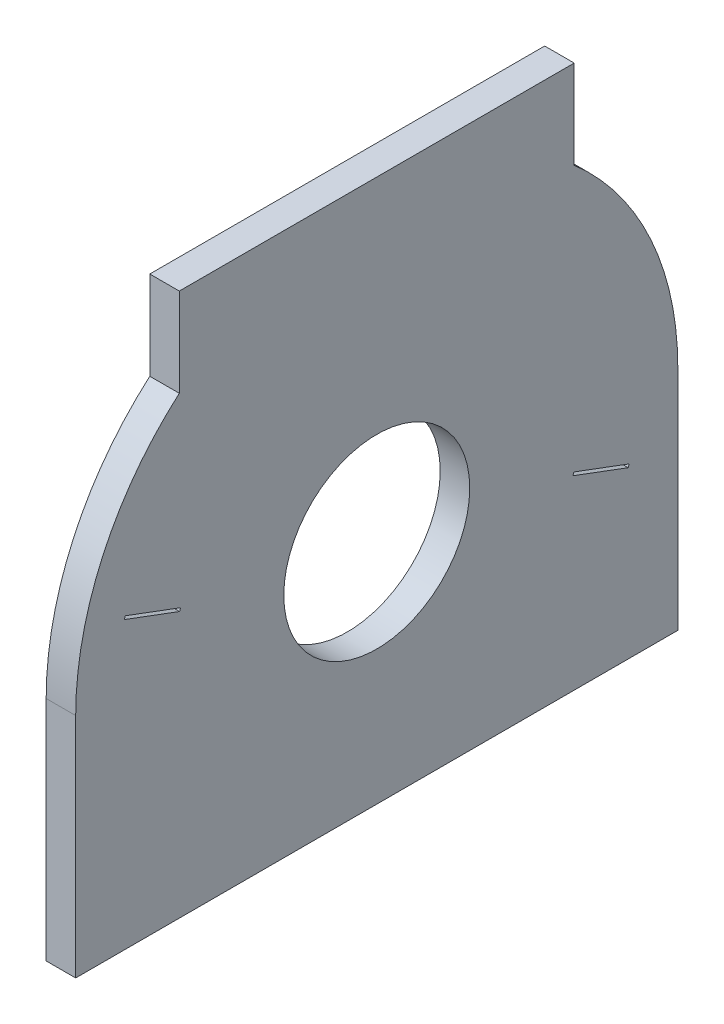
ISO-10303-21;
HEADER;
FILE_DESCRIPTION(('STEP AP214'),'2;1');
FILE_NAME('part.step','',(''),(''),'','','');
FILE_SCHEMA(('AUTOMOTIVE_DESIGN { 1 0 10303 214 1 1 1 1 }'));
ENDSEC;
DATA;
#1=APPLICATION_CONTEXT('core data for automotive mechanical design processes');
#2=APPLICATION_PROTOCOL_DEFINITION('international standard','automotive_design',2000,#1);
#3=PRODUCT_CONTEXT('',#1,'mechanical');
#4=PRODUCT('Part','Part','',(#3));
#5=PRODUCT_RELATED_PRODUCT_CATEGORY('part','',(#4));
#6=PRODUCT_DEFINITION_FORMATION('','',#4);
#7=PRODUCT_DEFINITION_CONTEXT('part definition',#1,'design');
#8=PRODUCT_DEFINITION('design','',#6,#7);
#9=PRODUCT_DEFINITION_SHAPE('','',#8);
#10=(LENGTH_UNIT() NAMED_UNIT(*) SI_UNIT(.MILLI.,.METRE.));
#11=(NAMED_UNIT(*) PLANE_ANGLE_UNIT() SI_UNIT($,.RADIAN.));
#12=(NAMED_UNIT(*) SI_UNIT($,.STERADIAN.) SOLID_ANGLE_UNIT());
#13=UNCERTAINTY_MEASURE_WITH_UNIT(LENGTH_MEASURE(1.E-05),#10,'distance_accuracy_value','');
#14=(GEOMETRIC_REPRESENTATION_CONTEXT(3) GLOBAL_UNCERTAINTY_ASSIGNED_CONTEXT((#13)) GLOBAL_UNIT_ASSIGNED_CONTEXT((#10,
#11,#12)) REPRESENTATION_CONTEXT('',''));
#15=CARTESIAN_POINT('',(0.,0.,0.));
#16=DIRECTION('',(0.,0.,1.));
#17=DIRECTION('',(1.,0.,0.));
#18=AXIS2_PLACEMENT_3D('',#15,#16,#17);
#19=CARTESIAN_POINT('',(-13.55,-11.6,0.));
#20=DIRECTION('',(-1.,0.,0.));
#21=DIRECTION('',(0.,0.,1.));
#22=AXIS2_PLACEMENT_3D('',#19,#20,#21);
#23=PLANE('',#22);
#24=CARTESIAN_POINT('',(-13.55,-11.6,0.));
#25=DIRECTION('',(-1.,0.,0.));
#26=DIRECTION('',(0.,0.,1.));
#27=AXIS2_PLACEMENT_3D('',#24,#25,#26);
#28=CIRCLE('',#27,3.15);
#29=CARTESIAN_POINT('',(-13.55,-11.6,3.15));
#30=VERTEX_POINT('',#29);
#31=EDGE_CURVE('E20',#30,#30,#28,.F.);
#32=ORIENTED_EDGE('',*,*,#31,.T.);
#33=EDGE_LOOP('',(#32));
#34=FACE_BOUND('',#33,.T.);
#35=DIRECTION('',(0.,0.936672189248387,-0.350207381259495));
#36=VECTOR('',#35,1.);
#37=CARTESIAN_POINT('',(-13.55,-9.512959009278,8.519161820185));
#38=LINE('',#37,#36);
#39=CARTESIAN_POINT('',(-13.55,-9.606626228203,8.55418255831101));
#40=VERTEX_POINT('',#39);
#41=CARTESIAN_POINT('',(-13.55,-9.51295900927981,8.51916182018568));
#42=VERTEX_POINT('',#41);
#43=EDGE_CURVE('E212',#40,#42,#38,.T.);
#44=ORIENTED_EDGE('',*,*,#43,.F.);
#45=DIRECTION('',(0.,0.350207381259495,0.936672189248387));
#46=VECTOR('',#45,1.);
#47=CARTESIAN_POINT('',(-13.55,-9.606626228203,8.554182558311));
#48=LINE('',#47,#46);
#49=CARTESIAN_POINT('',(-13.55,-10.3070409907207,6.68083817981524));
#50=VERTEX_POINT('',#49);
#51=EDGE_CURVE('E196',#50,#40,#48,.T.);
#52=ORIENTED_EDGE('',*,*,#51,.F.);
#53=DIRECTION('',(0.,-0.936672189248387,0.350207381259495));
#54=VECTOR('',#53,1.);
#55=CARTESIAN_POINT('',(-13.55,-10.30704099072,6.680838179815));
#56=LINE('',#55,#54);
#57=CARTESIAN_POINT('',(-13.55,-10.2133737717996,6.64581744169002));
#58=VERTEX_POINT('',#57);
#59=EDGE_CURVE('E93',#58,#50,#56,.T.);
#60=ORIENTED_EDGE('',*,*,#59,.F.);
#61=DIRECTION('',(0.,-0.350207381259495,-0.936672189248387));
#62=VECTOR('',#61,1.);
#63=CARTESIAN_POINT('',(-13.55,-10.2133737718,6.645817441689));
#64=LINE('',#63,#62);
#65=EDGE_CURVE('E218',#42,#58,#64,.T.);
#66=ORIENTED_EDGE('',*,*,#65,.F.);
#67=EDGE_LOOP('',(#44,#52,#60,#66));
#68=FACE_BOUND('',#67,.T.);
#69=DIRECTION('',(0.,0.936672189248387,-0.350207381259495));
#70=VECTOR('',#69,1.);
#71=CARTESIAN_POINT('',(-13.55,-12.89295900928,-6.680838179815));
#72=LINE('',#71,#70);
#73=CARTESIAN_POINT('',(-13.55,-12.9866262282004,-6.64581744169002));
#74=VERTEX_POINT('',#73);
#75=CARTESIAN_POINT('',(-13.55,-12.8929590092807,-6.68083817981473));
#76=VERTEX_POINT('',#75);
#77=EDGE_CURVE('E231',#74,#76,#72,.T.);
#78=ORIENTED_EDGE('',*,*,#77,.F.);
#79=DIRECTION('',(0.,0.350207381259495,0.936672189248387));
#80=VECTOR('',#79,1.);
#81=CARTESIAN_POINT('',(-13.55,-12.9866262282,-6.645817441689));
#82=LINE('',#81,#80);
#83=CARTESIAN_POINT('',(-13.55,-13.6870409907195,-8.51916182018518));
#84=VERTEX_POINT('',#83);
#85=EDGE_CURVE('E122',#84,#74,#82,.T.);
#86=ORIENTED_EDGE('',*,*,#85,.F.);
#87=DIRECTION('',(0.,-0.936672189248387,0.350207381259495));
#88=VECTOR('',#87,1.);
#89=CARTESIAN_POINT('',(-13.55,-13.68704099072,-8.519161820185));
#90=LINE('',#89,#88);
#91=CARTESIAN_POINT('',(-13.55,-13.5933737717996,-8.55418255830998));
#92=VERTEX_POINT('',#91);
#93=EDGE_CURVE('E119',#92,#84,#90,.T.);
#94=ORIENTED_EDGE('',*,*,#93,.F.);
#95=DIRECTION('',(0.,-0.350207381259495,-0.936672189248387));
#96=VECTOR('',#95,1.);
#97=CARTESIAN_POINT('',(-13.55,-13.5933737718,-8.554182558311));
#98=LINE('',#97,#96);
#99=EDGE_CURVE('E116',#76,#92,#98,.T.);
#100=ORIENTED_EDGE('',*,*,#99,.F.);
#101=EDGE_LOOP('',(#78,#86,#94,#100));
#102=FACE_BOUND('',#101,.T.);
#103=CARTESIAN_POINT('',(-13.55,-11.6,0.));
#104=DIRECTION('',(-1.,0.,0.));
#105=DIRECTION('',(0.,0.,1.));
#106=AXIS2_PLACEMENT_3D('',#103,#104,#105);
#107=CIRCLE('',#106,10.2);
#108=CARTESIAN_POINT('',(-13.55,-11.6,-10.2));
#109=VERTEX_POINT('',#108);
#110=CARTESIAN_POINT('',(-13.55,-3.90000000000013,-6.68954408012998));
#111=VERTEX_POINT('',#110);
#112=EDGE_CURVE('E189',#109,#111,#107,.F.);
#113=ORIENTED_EDGE('',*,*,#112,.F.);
#114=DIRECTION('',(0.,1.,0.));
#115=VECTOR('',#114,1.);
#116=CARTESIAN_POINT('',(-13.55,-22.9,-10.2));
#117=LINE('',#116,#115);
#118=CARTESIAN_POINT('',(-13.55,-19.3,-10.2));
#119=VERTEX_POINT('',#118);
#120=EDGE_CURVE('E155',#119,#109,#117,.T.);
#121=ORIENTED_EDGE('',*,*,#120,.F.);
#122=DIRECTION('',(0.,0.,1.));
#123=VECTOR('',#122,1.);
#124=CARTESIAN_POINT('',(-13.55,-19.3,14.3153457059952));
#125=LINE('',#124,#123);
#126=CARTESIAN_POINT('',(-13.55,-19.3,10.2));
#127=VERTEX_POINT('',#126);
#128=EDGE_CURVE('E150',#119,#127,#125,.T.);
#129=ORIENTED_EDGE('',*,*,#128,.T.);
#130=DIRECTION('',(0.,1.,0.));
#131=VECTOR('',#130,1.);
#132=CARTESIAN_POINT('',(-13.55,-11.6,10.2));
#133=LINE('',#132,#131);
#134=CARTESIAN_POINT('',(-13.55,-11.6,10.2));
#135=VERTEX_POINT('',#134);
#136=EDGE_CURVE('E145',#135,#127,#133,.F.);
#137=ORIENTED_EDGE('',*,*,#136,.F.);
#138=CARTESIAN_POINT('',(-13.55,-11.6,0.));
#139=DIRECTION('',(-1.,0.,0.));
#140=DIRECTION('',(0.,0.,1.));
#141=AXIS2_PLACEMENT_3D('',#138,#139,#140);
#142=CIRCLE('',#141,10.2);
#143=CARTESIAN_POINT('',(-13.55,-3.90000000000011,6.68954408013));
#144=VERTEX_POINT('',#143);
#145=EDGE_CURVE('E173',#144,#135,#142,.F.);
#146=ORIENTED_EDGE('',*,*,#145,.F.);
#147=DIRECTION('',(0.,1.,0.));
#148=VECTOR('',#147,1.);
#149=CARTESIAN_POINT('',(-13.55,-3.9,6.68954408013));
#150=LINE('',#149,#148);
#151=CARTESIAN_POINT('',(-13.55,-0.9,6.68954408013));
#152=VERTEX_POINT('',#151);
#153=EDGE_CURVE('E84',#152,#144,#150,.F.);
#154=ORIENTED_EDGE('',*,*,#153,.F.);
#155=DIRECTION('',(0.,0.,1.));
#156=VECTOR('',#155,1.);
#157=CARTESIAN_POINT('',(-13.55,-0.9,6.68954408013));
#158=LINE('',#157,#156);
#159=CARTESIAN_POINT('',(-13.55,-0.9,-6.68954408013));
#160=VERTEX_POINT('',#159);
#161=EDGE_CURVE('E167',#160,#152,#158,.T.);
#162=ORIENTED_EDGE('',*,*,#161,.F.);
#163=DIRECTION('',(0.,1.,0.));
#164=VECTOR('',#163,1.);
#165=CARTESIAN_POINT('',(-13.55,-0.9,-6.68954408013));
#166=LINE('',#165,#164);
#167=EDGE_CURVE('E161',#111,#160,#166,.T.);
#168=ORIENTED_EDGE('',*,*,#167,.F.);
#169=EDGE_LOOP('',(#113,#121,#129,#137,#146,#154,#162,#168));
#170=FACE_BOUND('',#169,.T.);
#171=ADVANCED_FACE('F17',(#34,#68,#102,#170),#23,.T.);
#172=CARTESIAN_POINT('',(-12.55,-13.68704099072,-8.519161820185));
#173=DIRECTION('',(0.,0.350207381259495,0.936672189248387));
#174=DIRECTION('',(0.,-0.936672189248387,0.350207381259495));
#175=AXIS2_PLACEMENT_3D('',#172,#173,#174);
#176=PLANE('',#175);
#177=DIRECTION('',(1.,0.,0.));
#178=VECTOR('',#177,1.);
#179=CARTESIAN_POINT('',(-12.55,-13.5933737717998,-8.55418255831059));
#180=LINE('',#179,#178);
#181=CARTESIAN_POINT('',(-12.55,-13.5933737717996,-8.55418255830998));
#182=VERTEX_POINT('',#181);
#183=EDGE_CURVE('E127',#92,#182,#180,.T.);
#184=ORIENTED_EDGE('',*,*,#183,.F.);
#185=ORIENTED_EDGE('',*,*,#93,.T.);
#186=DIRECTION('',(1.,0.,0.));
#187=VECTOR('',#186,1.);
#188=CARTESIAN_POINT('',(-12.55,-13.6870409907189,-8.51916182018543));
#189=LINE('',#188,#187);
#190=CARTESIAN_POINT('',(-12.55,-13.6870409907194,-8.51916182018521));
#191=VERTEX_POINT('',#190);
#192=EDGE_CURVE('E226',#191,#84,#189,.F.);
#193=ORIENTED_EDGE('',*,*,#192,.F.);
#194=DIRECTION('',(0.,0.936672189243805,-0.35020738127175));
#195=VECTOR('',#194,1.);
#196=CARTESIAN_POINT('',(-12.55,-13.6870409907194,-8.51916182018521));
#197=LINE('',#196,#195);
#198=EDGE_CURVE('E141',#191,#182,#197,.T.);
#199=ORIENTED_EDGE('',*,*,#198,.T.);
#200=EDGE_LOOP('',(#184,#185,#193,#199));
#201=FACE_BOUND('',#200,.T.);
#202=ADVANCED_FACE('F139',(#201),#176,.T.);
#203=CARTESIAN_POINT('',(-12.55,-13.5933737718,-8.554182558311));
#204=DIRECTION('',(0.,-0.936672189248387,0.350207381259495));
#205=DIRECTION('',(0.,-0.350207381259495,-0.936672189248387));
#206=AXIS2_PLACEMENT_3D('',#203,#204,#205);
#207=PLANE('',#206);
#208=DIRECTION('',(1.,0.,0.));
#209=VECTOR('',#208,1.);
#210=CARTESIAN_POINT('',(-12.55,-12.8929590092803,-6.68083817981489));
#211=LINE('',#210,#209);
#212=CARTESIAN_POINT('',(-12.55,-12.8929590092808,-6.68083817981471));
#213=VERTEX_POINT('',#212);
#214=EDGE_CURVE('E136',#76,#213,#211,.T.);
#215=ORIENTED_EDGE('',*,*,#214,.F.);
#216=ORIENTED_EDGE('',*,*,#99,.T.);
#217=ORIENTED_EDGE('',*,*,#183,.T.);
#218=DIRECTION('',(0.,0.35020738125978,0.936672189248281));
#219=VECTOR('',#218,1.);
#220=CARTESIAN_POINT('',(-12.55,-13.5933737717998,-8.55418255831059));
#221=LINE('',#220,#219);
#222=EDGE_CURVE('E244',#182,#213,#221,.T.);
#223=ORIENTED_EDGE('',*,*,#222,.T.);
#224=EDGE_LOOP('',(#215,#216,#217,#223));
#225=FACE_BOUND('',#224,.T.);
#226=ADVANCED_FACE('F132',(#225),#207,.T.);
#227=CARTESIAN_POINT('',(-12.55,-12.89295900928,-6.680838179815));
#228=DIRECTION('',(0.,-0.350207381259495,-0.936672189248387));
#229=DIRECTION('',(0.,0.936672189248387,-0.350207381259495));
#230=AXIS2_PLACEMENT_3D('',#227,#228,#229);
#231=PLANE('',#230);
#232=DIRECTION('',(1.,0.,0.));
#233=VECTOR('',#232,1.);
#234=CARTESIAN_POINT('',(-12.55,-12.9866262282002,-6.64581744168941));
#235=LINE('',#234,#233);
#236=CARTESIAN_POINT('',(-12.55,-12.9866262282004,-6.64581744169012));
#237=VERTEX_POINT('',#236);
#238=EDGE_CURVE('E228',#74,#237,#235,.T.);
#239=ORIENTED_EDGE('',*,*,#238,.F.);
#240=ORIENTED_EDGE('',*,*,#77,.T.);
#241=ORIENTED_EDGE('',*,*,#214,.T.);
#242=DIRECTION('',(0.,-0.936672189245345,0.350207381267631));
#243=VECTOR('',#242,1.);
#244=CARTESIAN_POINT('',(-12.55,-12.8929590092806,-6.68083817981479));
#245=LINE('',#244,#243);
#246=EDGE_CURVE('E239',#213,#237,#245,.T.);
#247=ORIENTED_EDGE('',*,*,#246,.T.);
#248=EDGE_LOOP('',(#239,#240,#241,#247));
#249=FACE_BOUND('',#248,.T.);
#250=ADVANCED_FACE('F237',(#249),#231,.T.);
#251=CARTESIAN_POINT('',(-12.55,-12.9866262282,-6.645817441689));
#252=DIRECTION('',(0.,0.936672189248387,-0.350207381259495));
#253=DIRECTION('',(0.,0.350207381259495,0.936672189248387));
#254=AXIS2_PLACEMENT_3D('',#251,#252,#253);
#255=PLANE('',#254);
#256=ORIENTED_EDGE('',*,*,#192,.T.);
#257=ORIENTED_EDGE('',*,*,#85,.T.);
#258=ORIENTED_EDGE('',*,*,#238,.T.);
#259=DIRECTION('',(0.,-0.350207381259779,-0.936672189248281));
#260=VECTOR('',#259,1.);
#261=CARTESIAN_POINT('',(-12.55,-12.9866262282003,-6.64581744168982));
#262=LINE('',#261,#260);
#263=EDGE_CURVE('E246',#237,#191,#262,.T.);
#264=ORIENTED_EDGE('',*,*,#263,.T.);
#265=EDGE_LOOP('',(#256,#257,#258,#264));
#266=FACE_BOUND('',#265,.T.);
#267=ADVANCED_FACE('F308',(#266),#255,.T.);
#268=CARTESIAN_POINT('',(-12.55,-10.30704099072,6.680838179815));
#269=DIRECTION('',(0.,0.350207381259495,0.936672189248387));
#270=DIRECTION('',(0.,-0.936672189248387,0.350207381259495));
#271=AXIS2_PLACEMENT_3D('',#268,#269,#270);
#272=PLANE('',#271);
#273=DIRECTION('',(1.,0.,0.));
#274=VECTOR('',#273,1.);
#275=CARTESIAN_POINT('',(-12.55,-10.2133737717998,6.64581744168941));
#276=LINE('',#275,#274);
#277=CARTESIAN_POINT('',(-12.55,-10.2133737717996,6.64581744169002));
#278=VERTEX_POINT('',#277);
#279=EDGE_CURVE('E221',#58,#278,#276,.T.);
#280=ORIENTED_EDGE('',*,*,#279,.F.);
#281=ORIENTED_EDGE('',*,*,#59,.T.);
#282=DIRECTION('',(1.,0.,0.));
#283=VECTOR('',#282,1.);
#284=CARTESIAN_POINT('',(-12.55,-10.3070409907215,6.68083817981556));
#285=LINE('',#284,#283);
#286=CARTESIAN_POINT('',(-12.55,-10.3070409907207,6.68083817981528));
#287=VERTEX_POINT('',#286);
#288=EDGE_CURVE('E200',#287,#50,#285,.F.);
#289=ORIENTED_EDGE('',*,*,#288,.F.);
#290=DIRECTION('',(0.,0.93667218924381,-0.350207381271738));
#291=VECTOR('',#290,1.);
#292=CARTESIAN_POINT('',(-12.55,-10.3070409907207,6.68083817981528));
#293=LINE('',#292,#291);
#294=EDGE_CURVE('E304',#287,#278,#293,.T.);
#295=ORIENTED_EDGE('',*,*,#294,.T.);
#296=EDGE_LOOP('',(#280,#281,#289,#295));
#297=FACE_BOUND('',#296,.T.);
#298=ADVANCED_FACE('F328',(#297),#272,.T.);
#299=CARTESIAN_POINT('',(-12.55,-10.2133737718,6.645817441689));
#300=DIRECTION('',(0.,-0.936672189248387,0.350207381259495));
#301=DIRECTION('',(0.,-0.350207381259495,-0.936672189248387));
#302=AXIS2_PLACEMENT_3D('',#299,#300,#301);
#303=PLANE('',#302);
#304=DIRECTION('',(1.,0.,0.));
#305=VECTOR('',#304,1.);
#306=CARTESIAN_POINT('',(-12.55,-9.51295900927872,8.51916182018527));
#307=LINE('',#306,#305);
#308=CARTESIAN_POINT('',(-12.55,-9.51295900927999,8.51916182018574));
#309=VERTEX_POINT('',#308);
#310=EDGE_CURVE('E215',#42,#309,#307,.T.);
#311=ORIENTED_EDGE('',*,*,#310,.F.);
#312=ORIENTED_EDGE('',*,*,#65,.T.);
#313=ORIENTED_EDGE('',*,*,#279,.T.);
#314=DIRECTION('',(0.,0.350207381260219,0.936672189248117));
#315=VECTOR('',#314,1.);
#316=CARTESIAN_POINT('',(-12.55,-10.2133737717998,6.64581744168941));
#317=LINE('',#316,#315);
#318=EDGE_CURVE('E301',#278,#309,#317,.T.);
#319=ORIENTED_EDGE('',*,*,#318,.T.);
#320=EDGE_LOOP('',(#311,#312,#313,#319));
#321=FACE_BOUND('',#320,.T.);
#322=ADVANCED_FACE('F327',(#321),#303,.T.);
#323=CARTESIAN_POINT('',(-12.55,-9.512959009278,8.519161820185));
#324=DIRECTION('',(0.,-0.350207381259495,-0.936672189248387));
#325=DIRECTION('',(0.,0.936672189248387,-0.350207381259495));
#326=AXIS2_PLACEMENT_3D('',#323,#324,#325);
#327=PLANE('',#326);
#328=DIRECTION('',(1.,0.,0.));
#329=VECTOR('',#328,1.);
#330=CARTESIAN_POINT('',(-12.55,-9.606626228203,8.554182558311));
#331=LINE('',#330,#329);
#332=CARTESIAN_POINT('',(-12.55,-9.606626228203,8.55418255831101));
#333=VERTEX_POINT('',#332);
#334=EDGE_CURVE('E206',#40,#333,#331,.T.);
#335=ORIENTED_EDGE('',*,*,#334,.F.);
#336=ORIENTED_EDGE('',*,*,#43,.T.);
#337=ORIENTED_EDGE('',*,*,#310,.T.);
#338=DIRECTION('',(0.,-0.936672189248402,0.350207381259455));
#339=VECTOR('',#338,1.);
#340=CARTESIAN_POINT('',(-12.55,-9.51295900927945,8.51916182018554));
#341=LINE('',#340,#339);
#342=EDGE_CURVE('E298',#309,#333,#341,.T.);
#343=ORIENTED_EDGE('',*,*,#342,.T.);
#344=EDGE_LOOP('',(#335,#336,#337,#343));
#345=FACE_BOUND('',#344,.T.);
#346=ADVANCED_FACE('F324',(#345),#327,.T.);
#347=CARTESIAN_POINT('',(-12.55,-9.606626228203,8.554182558311));
#348=DIRECTION('',(0.,0.936672189248387,-0.350207381259495));
#349=DIRECTION('',(0.,0.350207381259495,0.936672189248387));
#350=AXIS2_PLACEMENT_3D('',#347,#348,#349);
#351=PLANE('',#350);
#352=ORIENTED_EDGE('',*,*,#288,.T.);
#353=ORIENTED_EDGE('',*,*,#51,.T.);
#354=ORIENTED_EDGE('',*,*,#334,.T.);
#355=DIRECTION('',(0.,-0.350207381259122,-0.936672189248527));
#356=VECTOR('',#355,1.);
#357=CARTESIAN_POINT('',(-12.55,-9.606626228203,8.554182558311));
#358=LINE('',#357,#356);
#359=EDGE_CURVE('E188',#333,#287,#358,.T.);
#360=ORIENTED_EDGE('',*,*,#359,.T.);
#361=EDGE_LOOP('',(#352,#353,#354,#360));
#362=FACE_BOUND('',#361,.T.);
#363=ADVANCED_FACE('F319',(#362),#351,.T.);
#364=CARTESIAN_POINT('',(-12.55,-11.6,0.));
#365=DIRECTION('',(-1.,0.,0.));
#366=DIRECTION('',(0.,0.,1.));
#367=AXIS2_PLACEMENT_3D('',#364,#365,#366);
#368=CYLINDRICAL_SURFACE('',#367,3.15);
#369=ORIENTED_EDGE('',*,*,#31,.F.);
#370=EDGE_LOOP('',(#369));
#371=FACE_BOUND('',#370,.T.);
#372=CARTESIAN_POINT('',(-12.55,-11.6,0.));
#373=DIRECTION('',(-1.,0.,0.));
#374=DIRECTION('',(0.,0.,1.));
#375=AXIS2_PLACEMENT_3D('',#372,#373,#374);
#376=CIRCLE('',#375,3.15);
#377=CARTESIAN_POINT('',(-12.55,-11.6,3.15));
#378=VERTEX_POINT('',#377);
#379=EDGE_CURVE('E185',#378,#378,#376,.F.);
#380=ORIENTED_EDGE('',*,*,#379,.T.);
#381=EDGE_LOOP('',(#380));
#382=FACE_BOUND('',#381,.T.);
#383=ADVANCED_FACE('F366',(#371,#382),#368,.F.);
#384=CARTESIAN_POINT('',(-12.55,-11.6,0.));
#385=DIRECTION('',(-1.,0.,0.));
#386=DIRECTION('',(0.,0.,1.));
#387=AXIS2_PLACEMENT_3D('',#384,#385,#386);
#388=CYLINDRICAL_SURFACE('',#387,10.2);
#389=CARTESIAN_POINT('',(-12.55,-11.6,0.));
#390=DIRECTION('',(-1.,0.,0.));
#391=DIRECTION('',(0.,0.,1.));
#392=AXIS2_PLACEMENT_3D('',#389,#390,#391);
#393=CIRCLE('',#392,10.2);
#394=CARTESIAN_POINT('',(-12.55,-11.6,10.2));
#395=VERTEX_POINT('',#394);
#396=CARTESIAN_POINT('',(-12.55,-3.90000000000011,6.68954408013));
#397=VERTEX_POINT('',#396);
#398=EDGE_CURVE('E181',#395,#397,#393,.T.);
#399=ORIENTED_EDGE('',*,*,#398,.T.);
#400=DIRECTION('',(1.,0.,0.));
#401=VECTOR('',#400,1.);
#402=CARTESIAN_POINT('',(-13.55,-3.90000000000008,6.68954408013));
#403=LINE('',#402,#401);
#404=EDGE_CURVE('E169',#144,#397,#403,.T.);
#405=ORIENTED_EDGE('',*,*,#404,.F.);
#406=ORIENTED_EDGE('',*,*,#145,.T.);
#407=DIRECTION('',(1.,0.,0.));
#408=VECTOR('',#407,1.);
#409=CARTESIAN_POINT('',(-12.55,-11.6,10.2));
#410=LINE('',#409,#408);
#411=EDGE_CURVE('E147',#395,#135,#410,.F.);
#412=ORIENTED_EDGE('',*,*,#411,.F.);
#413=EDGE_LOOP('',(#399,#405,#406,#412));
#414=FACE_BOUND('',#413,.T.);
#415=ADVANCED_FACE('F363',(#414),#388,.T.);
#416=CARTESIAN_POINT('',(-13.55,-3.9,6.68954408013));
#417=DIRECTION('',(0.,0.,1.));
#418=DIRECTION('',(1.,0.,0.));
#419=AXIS2_PLACEMENT_3D('',#416,#417,#418);
#420=PLANE('',#419);
#421=DIRECTION('',(0.,1.,0.));
#422=VECTOR('',#421,1.);
#423=CARTESIAN_POINT('',(-12.55,-11.6,6.68954408013));
#424=LINE('',#423,#422);
#425=CARTESIAN_POINT('',(-12.55,-0.9,6.68954408013));
#426=VERTEX_POINT('',#425);
#427=EDGE_CURVE('E184',#397,#426,#424,.T.);
#428=ORIENTED_EDGE('',*,*,#427,.T.);
#429=DIRECTION('',(1.,0.,0.));
#430=VECTOR('',#429,1.);
#431=CARTESIAN_POINT('',(-13.55,-0.9,6.68954408013));
#432=LINE('',#431,#430);
#433=EDGE_CURVE('E164',#152,#426,#432,.T.);
#434=ORIENTED_EDGE('',*,*,#433,.F.);
#435=ORIENTED_EDGE('',*,*,#153,.T.);
#436=ORIENTED_EDGE('',*,*,#404,.T.);
#437=EDGE_LOOP('',(#428,#434,#435,#436));
#438=FACE_BOUND('',#437,.T.);
#439=ADVANCED_FACE('F288',(#438),#420,.T.);
#440=CARTESIAN_POINT('',(-13.55,-0.9,6.68954408013));
#441=DIRECTION('',(0.,1.,0.));
#442=DIRECTION('',(0.,0.,1.));
#443=AXIS2_PLACEMENT_3D('',#440,#441,#442);
#444=PLANE('',#443);
#445=ORIENTED_EDGE('',*,*,#433,.T.);
#446=DIRECTION('',(0.,0.,1.));
#447=VECTOR('',#446,1.);
#448=CARTESIAN_POINT('',(-12.55,-0.9,0.));
#449=LINE('',#448,#447);
#450=CARTESIAN_POINT('',(-12.55,-0.9,-6.68954408013));
#451=VERTEX_POINT('',#450);
#452=EDGE_CURVE('E269',#426,#451,#449,.F.);
#453=ORIENTED_EDGE('',*,*,#452,.T.);
#454=DIRECTION('',(-1.,0.,0.));
#455=VECTOR('',#454,1.);
#456=CARTESIAN_POINT('',(-13.55,-0.9,-6.68954408013));
#457=LINE('',#456,#455);
#458=EDGE_CURVE('E163',#160,#451,#457,.F.);
#459=ORIENTED_EDGE('',*,*,#458,.F.);
#460=ORIENTED_EDGE('',*,*,#161,.T.);
#461=EDGE_LOOP('',(#445,#453,#459,#460));
#462=FACE_BOUND('',#461,.T.);
#463=ADVANCED_FACE('F277',(#462),#444,.T.);
#464=CARTESIAN_POINT('',(-13.55,-0.9,-6.68954408013));
#465=DIRECTION('',(0.,0.,-1.));
#466=DIRECTION('',(-1.,0.,0.));
#467=AXIS2_PLACEMENT_3D('',#464,#465,#466);
#468=PLANE('',#467);
#469=ORIENTED_EDGE('',*,*,#167,.T.);
#470=ORIENTED_EDGE('',*,*,#458,.T.);
#471=DIRECTION('',(0.,1.,0.));
#472=VECTOR('',#471,1.);
#473=CARTESIAN_POINT('',(-12.55,-11.6,-6.68954408013));
#474=LINE('',#473,#472);
#475=CARTESIAN_POINT('',(-12.55,-3.90000000000014,-6.68954408012998));
#476=VERTEX_POINT('',#475);
#477=EDGE_CURVE('E180',#451,#476,#474,.F.);
#478=ORIENTED_EDGE('',*,*,#477,.T.);
#479=DIRECTION('',(-1.,0.,0.));
#480=VECTOR('',#479,1.);
#481=CARTESIAN_POINT('',(-12.55,-3.90000000000012,-6.68954408012996));
#482=LINE('',#481,#480);
#483=EDGE_CURVE('E158',#111,#476,#482,.F.);
#484=ORIENTED_EDGE('',*,*,#483,.F.);
#485=EDGE_LOOP('',(#469,#470,#478,#484));
#486=FACE_BOUND('',#485,.T.);
#487=ADVANCED_FACE('F354',(#486),#468,.T.);
#488=CARTESIAN_POINT('',(-12.55,-11.6,0.));
#489=DIRECTION('',(-1.,0.,0.));
#490=DIRECTION('',(0.,0.,1.));
#491=AXIS2_PLACEMENT_3D('',#488,#489,#490);
#492=CYLINDRICAL_SURFACE('',#491,10.2);
#493=ORIENTED_EDGE('',*,*,#112,.T.);
#494=ORIENTED_EDGE('',*,*,#483,.T.);
#495=CARTESIAN_POINT('',(-12.55,-11.6,0.));
#496=DIRECTION('',(-1.,0.,0.));
#497=DIRECTION('',(0.,0.,1.));
#498=AXIS2_PLACEMENT_3D('',#495,#496,#497);
#499=CIRCLE('',#498,10.2);
#500=CARTESIAN_POINT('',(-12.55,-11.6,-10.2));
#501=VERTEX_POINT('',#500);
#502=EDGE_CURVE('E176',#476,#501,#499,.T.);
#503=ORIENTED_EDGE('',*,*,#502,.T.);
#504=DIRECTION('',(-1.,0.,0.));
#505=VECTOR('',#504,1.);
#506=CARTESIAN_POINT('',(-12.55,-11.6,-10.2));
#507=LINE('',#506,#505);
#508=EDGE_CURVE('E157',#109,#501,#507,.F.);
#509=ORIENTED_EDGE('',*,*,#508,.F.);
#510=EDGE_LOOP('',(#493,#494,#503,#509));
#511=FACE_BOUND('',#510,.T.);
#512=ADVANCED_FACE('F350',(#511),#492,.T.);
#513=CARTESIAN_POINT('',(-12.55,-22.9,-10.2));
#514=DIRECTION('',(0.,0.,-1.));
#515=DIRECTION('',(-1.,0.,0.));
#516=AXIS2_PLACEMENT_3D('',#513,#514,#515);
#517=PLANE('',#516);
#518=ORIENTED_EDGE('',*,*,#508,.T.);
#519=DIRECTION('',(0.,1.,0.));
#520=VECTOR('',#519,1.);
#521=CARTESIAN_POINT('',(-12.55,-11.6,-10.2));
#522=LINE('',#521,#520);
#523=CARTESIAN_POINT('',(-12.55,-19.3,-10.2));
#524=VERTEX_POINT('',#523);
#525=EDGE_CURVE('E179',#501,#524,#522,.F.);
#526=ORIENTED_EDGE('',*,*,#525,.T.);
#527=DIRECTION('',(1.,0.,0.));
#528=VECTOR('',#527,1.);
#529=CARTESIAN_POINT('',(26.2245314429007,-19.3,-10.2));
#530=LINE('',#529,#528);
#531=EDGE_CURVE('E152',#524,#119,#530,.F.);
#532=ORIENTED_EDGE('',*,*,#531,.T.);
#533=ORIENTED_EDGE('',*,*,#120,.T.);
#534=EDGE_LOOP('',(#518,#526,#532,#533));
#535=FACE_BOUND('',#534,.T.);
#536=ADVANCED_FACE('F346',(#535),#517,.T.);
#537=CARTESIAN_POINT('',(26.2245314429007,-19.3,14.3153457059952));
#538=DIRECTION('',(0.,1.,0.));
#539=DIRECTION('',(0.,0.,1.));
#540=AXIS2_PLACEMENT_3D('',#537,#538,#539);
#541=PLANE('',#540);
#542=ORIENTED_EDGE('',*,*,#128,.F.);
#543=ORIENTED_EDGE('',*,*,#531,.F.);
#544=DIRECTION('',(0.,0.,1.));
#545=VECTOR('',#544,1.);
#546=CARTESIAN_POINT('',(-12.55,-19.3,0.));
#547=LINE('',#546,#545);
#548=CARTESIAN_POINT('',(-12.55,-19.3,10.2));
#549=VERTEX_POINT('',#548);
#550=EDGE_CURVE('E26',#524,#549,#547,.T.);
#551=ORIENTED_EDGE('',*,*,#550,.T.);
#552=DIRECTION('',(1.,0.,0.));
#553=VECTOR('',#552,1.);
#554=CARTESIAN_POINT('',(-12.55,-19.3,10.2));
#555=LINE('',#554,#553);
#556=EDGE_CURVE('E34',#127,#549,#555,.T.);
#557=ORIENTED_EDGE('',*,*,#556,.F.);
#558=EDGE_LOOP('',(#542,#543,#551,#557));
#559=FACE_BOUND('',#558,.T.);
#560=ADVANCED_FACE('F341',(#559),#541,.F.);
#561=CARTESIAN_POINT('',(-12.55,-11.6,10.2));
#562=DIRECTION('',(0.,0.,1.));
#563=DIRECTION('',(1.,0.,0.));
#564=AXIS2_PLACEMENT_3D('',#561,#562,#563);
#565=PLANE('',#564);
#566=ORIENTED_EDGE('',*,*,#411,.T.);
#567=ORIENTED_EDGE('',*,*,#136,.T.);
#568=ORIENTED_EDGE('',*,*,#556,.T.);
#569=DIRECTION('',(0.,1.,0.));
#570=VECTOR('',#569,1.);
#571=CARTESIAN_POINT('',(-12.55,-11.6,10.2));
#572=LINE('',#571,#570);
#573=EDGE_CURVE('E11',#549,#395,#572,.T.);
#574=ORIENTED_EDGE('',*,*,#573,.T.);
#575=EDGE_LOOP('',(#566,#567,#568,#574));
#576=FACE_BOUND('',#575,.T.);
#577=ADVANCED_FACE('F336',(#576),#565,.T.);
#578=CARTESIAN_POINT('',(-12.55,-11.6,0.));
#579=DIRECTION('',(-1.,0.,0.));
#580=DIRECTION('',(0.,0.,1.));
#581=AXIS2_PLACEMENT_3D('',#578,#579,#580);
#582=PLANE('',#581);
#583=ORIENTED_EDGE('',*,*,#550,.F.);
#584=ORIENTED_EDGE('',*,*,#525,.F.);
#585=ORIENTED_EDGE('',*,*,#502,.F.);
#586=ORIENTED_EDGE('',*,*,#477,.F.);
#587=ORIENTED_EDGE('',*,*,#452,.F.);
#588=ORIENTED_EDGE('',*,*,#427,.F.);
#589=ORIENTED_EDGE('',*,*,#398,.F.);
#590=ORIENTED_EDGE('',*,*,#573,.F.);
#591=EDGE_LOOP('',(#583,#584,#585,#586,#587,#588,#589,#590));
#592=FACE_BOUND('',#591,.T.);
#593=ORIENTED_EDGE('',*,*,#379,.F.);
#594=EDGE_LOOP('',(#593));
#595=FACE_BOUND('',#594,.T.);
#596=ORIENTED_EDGE('',*,*,#342,.F.);
#597=ORIENTED_EDGE('',*,*,#318,.F.);
#598=ORIENTED_EDGE('',*,*,#294,.F.);
#599=ORIENTED_EDGE('',*,*,#359,.F.);
#600=EDGE_LOOP('',(#596,#597,#598,#599));
#601=FACE_BOUND('',#600,.T.);
#602=ORIENTED_EDGE('',*,*,#246,.F.);
#603=ORIENTED_EDGE('',*,*,#222,.F.);
#604=ORIENTED_EDGE('',*,*,#198,.F.);
#605=ORIENTED_EDGE('',*,*,#263,.F.);
#606=EDGE_LOOP('',(#602,#603,#604,#605));
#607=FACE_BOUND('',#606,.T.);
#608=ADVANCED_FACE('F243',(#592,#595,#601,#607),#582,.F.);
#609=CLOSED_SHELL('',(#171,#202,#226,#250,#267,#298,#322,#346,#363,#383,#415,#439,#463,#487,
#512,#536,#560,#577,#608));
#610=MANIFOLD_SOLID_BREP('B1',#609);
#611=ADVANCED_BREP_SHAPE_REPRESENTATION('',(#18,#610),#14);
#612=SHAPE_DEFINITION_REPRESENTATION(#9,#611);
ENDSEC;
END-ISO-10303-21;
